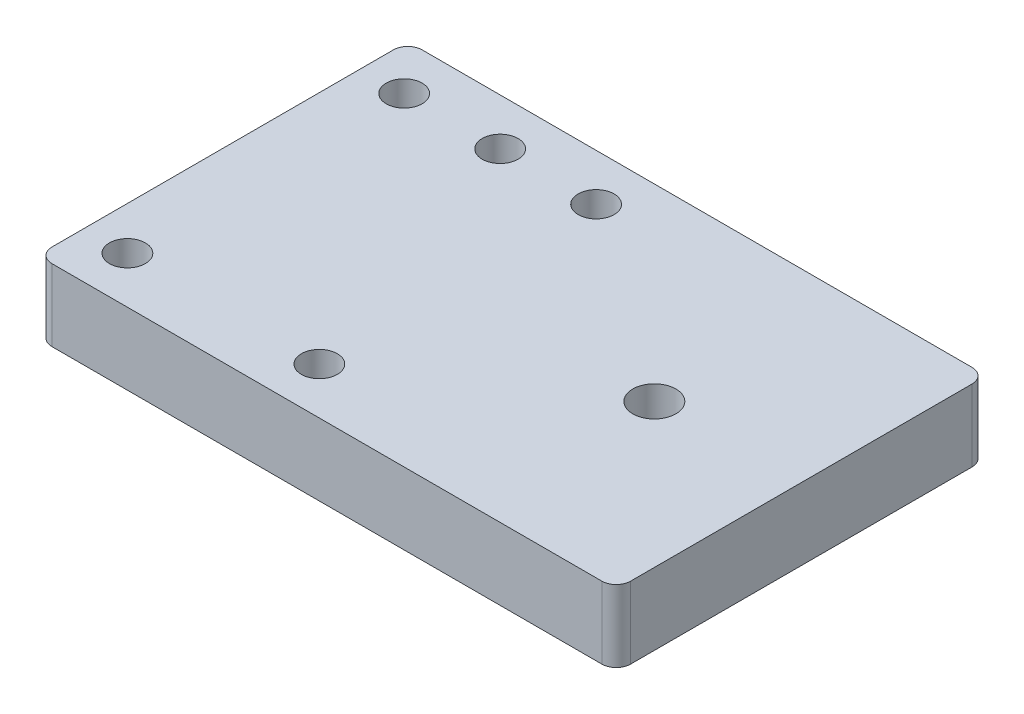
ISO-10303-21;
HEADER;
FILE_DESCRIPTION(('STEP AP214'),'2;1');
FILE_NAME('part.step','',(''),(''),'','','');
FILE_SCHEMA(('AUTOMOTIVE_DESIGN { 1 0 10303 214 1 1 1 1 }'));
ENDSEC;
DATA;
#1=APPLICATION_CONTEXT('core data for automotive mechanical design processes');
#2=APPLICATION_PROTOCOL_DEFINITION('international standard','automotive_design',2000,#1);
#3=PRODUCT_CONTEXT('',#1,'mechanical');
#4=PRODUCT('Part','Part','',(#3));
#5=PRODUCT_RELATED_PRODUCT_CATEGORY('part','',(#4));
#6=PRODUCT_DEFINITION_FORMATION('','',#4);
#7=PRODUCT_DEFINITION_CONTEXT('part definition',#1,'design');
#8=PRODUCT_DEFINITION('design','',#6,#7);
#9=PRODUCT_DEFINITION_SHAPE('','',#8);
#10=(LENGTH_UNIT() NAMED_UNIT(*) SI_UNIT(.MILLI.,.METRE.));
#11=(NAMED_UNIT(*) PLANE_ANGLE_UNIT() SI_UNIT($,.RADIAN.));
#12=(NAMED_UNIT(*) SI_UNIT($,.STERADIAN.) SOLID_ANGLE_UNIT());
#13=UNCERTAINTY_MEASURE_WITH_UNIT(LENGTH_MEASURE(1.E-05),#10,'distance_accuracy_value','');
#14=(GEOMETRIC_REPRESENTATION_CONTEXT(3) GLOBAL_UNCERTAINTY_ASSIGNED_CONTEXT((#13)) GLOBAL_UNIT_ASSIGNED_CONTEXT((#10,
#11,#12)) REPRESENTATION_CONTEXT('',''));
#15=CARTESIAN_POINT('',(0.,0.,0.));
#16=DIRECTION('',(0.,0.,1.));
#17=DIRECTION('',(1.,0.,0.));
#18=AXIS2_PLACEMENT_3D('',#15,#16,#17);
#19=CARTESIAN_POINT('',(40.2499999999999,10.,25.75));
#20=DIRECTION('',(-1.,0.,0.));
#21=DIRECTION('',(0.,0.,1.));
#22=AXIS2_PLACEMENT_3D('',#19,#20,#21);
#23=PLANE('',#22);
#24=DIRECTION('',(0.,0.,-1.));
#25=VECTOR('',#24,1.);
#26=CARTESIAN_POINT('',(40.2499999999999,0.,25.75));
#27=LINE('',#26,#25);
#28=CARTESIAN_POINT('',(40.2499999999999,0.,23.75));
#29=VERTEX_POINT('',#28);
#30=CARTESIAN_POINT('',(40.2499999999999,0.,-23.7499999999998));
#31=VERTEX_POINT('',#30);
#32=EDGE_CURVE('E126',#29,#31,#27,.T.);
#33=ORIENTED_EDGE('',*,*,#32,.T.);
#34=DIRECTION('',(0.,-1.,0.));
#35=VECTOR('',#34,1.);
#36=CARTESIAN_POINT('',(40.2499999999999,10.,-23.7499999999998));
#37=LINE('',#36,#35);
#38=CARTESIAN_POINT('',(40.2499999999999,10.,-23.7499999999998));
#39=VERTEX_POINT('',#38);
#40=EDGE_CURVE('E104',#31,#39,#37,.F.);
#41=ORIENTED_EDGE('',*,*,#40,.T.);
#42=DIRECTION('',(0.,0.,-1.));
#43=VECTOR('',#42,1.);
#44=CARTESIAN_POINT('',(40.2499999999999,10.,25.75));
#45=LINE('',#44,#43);
#46=CARTESIAN_POINT('',(40.2499999999999,10.,23.75));
#47=VERTEX_POINT('',#46);
#48=EDGE_CURVE('E136',#47,#39,#45,.T.);
#49=ORIENTED_EDGE('',*,*,#48,.F.);
#50=DIRECTION('',(0.,-1.,0.));
#51=VECTOR('',#50,1.);
#52=CARTESIAN_POINT('',(40.2499999999999,10.,23.75));
#53=LINE('',#52,#51);
#54=EDGE_CURVE('E109',#47,#29,#53,.T.);
#55=ORIENTED_EDGE('',*,*,#54,.T.);
#56=EDGE_LOOP('',(#33,#41,#49,#55));
#57=FACE_BOUND('',#56,.T.);
#58=ADVANCED_FACE('F33',(#57),#23,.F.);
#59=CARTESIAN_POINT('',(-40.2500000000001,10.,-25.7499999999998));
#60=DIRECTION('',(0.,0.,1.));
#61=DIRECTION('',(1.,0.,0.));
#62=AXIS2_PLACEMENT_3D('',#59,#60,#61);
#63=PLANE('',#62);
#64=DIRECTION('',(-1.,0.,0.));
#65=VECTOR('',#64,1.);
#66=CARTESIAN_POINT('',(-40.2500000000001,10.,-25.7499999999998));
#67=LINE('',#66,#65);
#68=CARTESIAN_POINT('',(38.2499999999999,10.,-25.7499999999998));
#69=VERTEX_POINT('',#68);
#70=CARTESIAN_POINT('',(-38.2500000000001,10.,-25.7499999999998));
#71=VERTEX_POINT('',#70);
#72=EDGE_CURVE('E119',#69,#71,#67,.T.);
#73=ORIENTED_EDGE('',*,*,#72,.F.);
#74=DIRECTION('',(0.,-1.,0.));
#75=VECTOR('',#74,1.);
#76=CARTESIAN_POINT('',(38.2499999999999,10.,-25.7499999999998));
#77=LINE('',#76,#75);
#78=CARTESIAN_POINT('',(38.2499999999999,0.,-25.7499999999998));
#79=VERTEX_POINT('',#78);
#80=EDGE_CURVE('E103',#69,#79,#77,.T.);
#81=ORIENTED_EDGE('',*,*,#80,.T.);
#82=DIRECTION('',(-1.,0.,0.));
#83=VECTOR('',#82,1.);
#84=CARTESIAN_POINT('',(-40.2500000000001,0.,-25.7499999999998));
#85=LINE('',#84,#83);
#86=CARTESIAN_POINT('',(-38.2500000000001,0.,-25.7499999999998));
#87=VERTEX_POINT('',#86);
#88=EDGE_CURVE('E116',#79,#87,#85,.T.);
#89=ORIENTED_EDGE('',*,*,#88,.T.);
#90=DIRECTION('',(0.,-1.,0.));
#91=VECTOR('',#90,1.);
#92=CARTESIAN_POINT('',(-38.2500000000001,10.,-25.7499999999998));
#93=LINE('',#92,#91);
#94=EDGE_CURVE('E121',#87,#71,#93,.F.);
#95=ORIENTED_EDGE('',*,*,#94,.T.);
#96=EDGE_LOOP('',(#73,#81,#89,#95));
#97=FACE_BOUND('',#96,.T.);
#98=ADVANCED_FACE('F115',(#97),#63,.F.);
#99=CARTESIAN_POINT('',(-40.2500000000001,10.,25.75));
#100=DIRECTION('',(1.,0.,0.));
#101=DIRECTION('',(0.,0.,-1.));
#102=AXIS2_PLACEMENT_3D('',#99,#100,#101);
#103=PLANE('',#102);
#104=DIRECTION('',(0.,0.,1.));
#105=VECTOR('',#104,1.);
#106=CARTESIAN_POINT('',(-40.2500000000001,0.,25.75));
#107=LINE('',#106,#105);
#108=CARTESIAN_POINT('',(-40.2500000000001,0.,-23.7499999999998));
#109=VERTEX_POINT('',#108);
#110=CARTESIAN_POINT('',(-40.2500000000001,0.,23.75));
#111=VERTEX_POINT('',#110);
#112=EDGE_CURVE('E125',#109,#111,#107,.T.);
#113=ORIENTED_EDGE('',*,*,#112,.T.);
#114=DIRECTION('',(0.,-1.,0.));
#115=VECTOR('',#114,1.);
#116=CARTESIAN_POINT('',(-40.2500000000001,10.,23.75));
#117=LINE('',#116,#115);
#118=CARTESIAN_POINT('',(-40.2500000000001,10.,23.75));
#119=VERTEX_POINT('',#118);
#120=EDGE_CURVE('E11',#111,#119,#117,.F.);
#121=ORIENTED_EDGE('',*,*,#120,.T.);
#122=DIRECTION('',(0.,0.,1.));
#123=VECTOR('',#122,1.);
#124=CARTESIAN_POINT('',(-40.2500000000001,10.,25.75));
#125=LINE('',#124,#123);
#126=CARTESIAN_POINT('',(-40.2500000000001,10.,-23.7499999999998));
#127=VERTEX_POINT('',#126);
#128=EDGE_CURVE('E162',#127,#119,#125,.T.);
#129=ORIENTED_EDGE('',*,*,#128,.F.);
#130=DIRECTION('',(0.,-1.,0.));
#131=VECTOR('',#130,1.);
#132=CARTESIAN_POINT('',(-40.2500000000001,10.,-23.7499999999998));
#133=LINE('',#132,#131);
#134=EDGE_CURVE('E41',#127,#109,#133,.T.);
#135=ORIENTED_EDGE('',*,*,#134,.T.);
#136=EDGE_LOOP('',(#113,#121,#129,#135));
#137=FACE_BOUND('',#136,.T.);
#138=ADVANCED_FACE('F160',(#137),#103,.F.);
#139=CARTESIAN_POINT('',(-40.2500000000001,10.,25.75));
#140=DIRECTION('',(0.,0.,-1.));
#141=DIRECTION('',(-1.,0.,0.));
#142=AXIS2_PLACEMENT_3D('',#139,#140,#141);
#143=PLANE('',#142);
#144=DIRECTION('',(1.,0.,0.));
#145=VECTOR('',#144,1.);
#146=CARTESIAN_POINT('',(-40.2500000000001,0.,25.75));
#147=LINE('',#146,#145);
#148=CARTESIAN_POINT('',(-38.2500000000001,0.,25.75));
#149=VERTEX_POINT('',#148);
#150=CARTESIAN_POINT('',(38.2499999999999,0.,25.75));
#151=VERTEX_POINT('',#150);
#152=EDGE_CURVE('E129',#149,#151,#147,.T.);
#153=ORIENTED_EDGE('',*,*,#152,.T.);
#154=DIRECTION('',(0.,-1.,0.));
#155=VECTOR('',#154,1.);
#156=CARTESIAN_POINT('',(38.2499999999999,10.,25.75));
#157=LINE('',#156,#155);
#158=CARTESIAN_POINT('',(38.2499999999999,10.,25.75));
#159=VERTEX_POINT('',#158);
#160=EDGE_CURVE('E48',#151,#159,#157,.F.);
#161=ORIENTED_EDGE('',*,*,#160,.T.);
#162=DIRECTION('',(1.,0.,0.));
#163=VECTOR('',#162,1.);
#164=CARTESIAN_POINT('',(-40.2500000000001,10.,25.75));
#165=LINE('',#164,#163);
#166=CARTESIAN_POINT('',(-38.2500000000001,10.,25.75));
#167=VERTEX_POINT('',#166);
#168=EDGE_CURVE('E137',#167,#159,#165,.T.);
#169=ORIENTED_EDGE('',*,*,#168,.F.);
#170=DIRECTION('',(0.,-1.,0.));
#171=VECTOR('',#170,1.);
#172=CARTESIAN_POINT('',(-38.2500000000001,10.,25.75));
#173=LINE('',#172,#171);
#174=EDGE_CURVE('E153',#167,#149,#173,.T.);
#175=ORIENTED_EDGE('',*,*,#174,.T.);
#176=EDGE_LOOP('',(#153,#161,#169,#175));
#177=FACE_BOUND('',#176,.T.);
#178=ADVANCED_FACE('F169',(#177),#143,.F.);
#179=CARTESIAN_POINT('',(0.,10.,0.));
#180=DIRECTION('',(0.,-1.,0.));
#181=DIRECTION('',(0.,0.,-1.));
#182=AXIS2_PLACEMENT_3D('',#179,#180,#181);
#183=PLANE('',#182);
#184=CARTESIAN_POINT('',(20.2499999999999,10.,0.450000000000051));
#185=DIRECTION('',(0.,1.,0.));
#186=DIRECTION('',(0.,0.,1.));
#187=AXIS2_PLACEMENT_3D('',#184,#185,#186);
#188=CIRCLE('',#187,3.);
#189=CARTESIAN_POINT('',(20.2499999999999,10.,3.45000000000005));
#190=VERTEX_POINT('',#189);
#191=EDGE_CURVE('E206',#190,#190,#188,.T.);
#192=ORIENTED_EDGE('',*,*,#191,.F.);
#193=EDGE_LOOP('',(#192));
#194=FACE_BOUND('',#193,.T.);
#195=CARTESIAN_POINT('',(-20.9000000000001,10.,-19.25));
#196=DIRECTION('',(0.,1.,0.));
#197=DIRECTION('',(0.,0.,1.));
#198=AXIS2_PLACEMENT_3D('',#195,#196,#197);
#199=CIRCLE('',#198,2.5);
#200=CARTESIAN_POINT('',(-20.9000000000001,10.,-16.75));
#201=VERTEX_POINT('',#200);
#202=EDGE_CURVE('E200',#201,#201,#199,.T.);
#203=ORIENTED_EDGE('',*,*,#202,.F.);
#204=EDGE_LOOP('',(#203));
#205=FACE_BOUND('',#204,.T.);
#206=CARTESIAN_POINT('',(-34.2500000000001,10.,19.25));
#207=DIRECTION('',(0.,-1.,0.));
#208=DIRECTION('',(0.,0.,-1.));
#209=AXIS2_PLACEMENT_3D('',#206,#207,#208);
#210=CIRCLE('',#209,2.49999999999999);
#211=CARTESIAN_POINT('',(-34.2500000000001,10.,16.75));
#212=VERTEX_POINT('',#211);
#213=EDGE_CURVE('E194',#212,#212,#210,.T.);
#214=ORIENTED_EDGE('',*,*,#213,.T.);
#215=EDGE_LOOP('',(#214));
#216=FACE_BOUND('',#215,.T.);
#217=CARTESIAN_POINT('',(-7.55000000000009,10.,19.25));
#218=DIRECTION('',(0.,1.,0.));
#219=DIRECTION('',(0.,0.,-1.));
#220=AXIS2_PLACEMENT_3D('',#217,#218,#219);
#221=CIRCLE('',#220,2.49999999999999);
#222=CARTESIAN_POINT('',(-7.55000000000009,10.,16.75));
#223=VERTEX_POINT('',#222);
#224=EDGE_CURVE('E188',#223,#223,#221,.T.);
#225=ORIENTED_EDGE('',*,*,#224,.F.);
#226=EDGE_LOOP('',(#225));
#227=FACE_BOUND('',#226,.T.);
#228=CARTESIAN_POINT('',(-7.55000000000009,10.,-19.25));
#229=DIRECTION('',(0.,-1.,0.));
#230=DIRECTION('',(0.,0.,1.));
#231=AXIS2_PLACEMENT_3D('',#228,#229,#230);
#232=CIRCLE('',#231,2.49999999999999);
#233=CARTESIAN_POINT('',(-7.55000000000009,10.,-16.75));
#234=VERTEX_POINT('',#233);
#235=EDGE_CURVE('E182',#234,#234,#232,.T.);
#236=ORIENTED_EDGE('',*,*,#235,.T.);
#237=EDGE_LOOP('',(#236));
#238=FACE_BOUND('',#237,.T.);
#239=CARTESIAN_POINT('',(-34.2500000000001,10.,-19.25));
#240=DIRECTION('',(0.,1.,0.));
#241=DIRECTION('',(0.,0.,1.));
#242=AXIS2_PLACEMENT_3D('',#239,#240,#241);
#243=CIRCLE('',#242,2.49999999999999);
#244=CARTESIAN_POINT('',(-34.2500000000001,10.,-16.75));
#245=VERTEX_POINT('',#244);
#246=EDGE_CURVE('E176',#245,#245,#243,.T.);
#247=ORIENTED_EDGE('',*,*,#246,.F.);
#248=EDGE_LOOP('',(#247));
#249=FACE_BOUND('',#248,.T.);
#250=ORIENTED_EDGE('',*,*,#48,.T.);
#251=CARTESIAN_POINT('',(38.2499999999999,10.,-23.7499999999998));
#252=DIRECTION('',(0.,-1.,0.));
#253=DIRECTION('',(0.,0.,-1.));
#254=AXIS2_PLACEMENT_3D('',#251,#252,#253);
#255=CIRCLE('',#254,2.);
#256=EDGE_CURVE('E151',#39,#69,#255,.F.);
#257=ORIENTED_EDGE('',*,*,#256,.T.);
#258=ORIENTED_EDGE('',*,*,#72,.T.);
#259=CARTESIAN_POINT('',(-38.2500000000001,10.,-23.7499999999998));
#260=DIRECTION('',(0.,-1.,0.));
#261=DIRECTION('',(0.,0.,-1.));
#262=AXIS2_PLACEMENT_3D('',#259,#260,#261);
#263=CIRCLE('',#262,2.);
#264=EDGE_CURVE('E146',#71,#127,#263,.F.);
#265=ORIENTED_EDGE('',*,*,#264,.T.);
#266=ORIENTED_EDGE('',*,*,#128,.T.);
#267=CARTESIAN_POINT('',(-38.2500000000001,10.,23.75));
#268=DIRECTION('',(0.,-1.,0.));
#269=DIRECTION('',(0.,0.,-1.));
#270=AXIS2_PLACEMENT_3D('',#267,#268,#269);
#271=CIRCLE('',#270,2.);
#272=EDGE_CURVE('E55',#119,#167,#271,.F.);
#273=ORIENTED_EDGE('',*,*,#272,.T.);
#274=ORIENTED_EDGE('',*,*,#168,.T.);
#275=CARTESIAN_POINT('',(38.2499999999999,10.,23.75));
#276=DIRECTION('',(0.,-1.,0.));
#277=DIRECTION('',(0.,0.,-1.));
#278=AXIS2_PLACEMENT_3D('',#275,#276,#277);
#279=CIRCLE('',#278,2.);
#280=EDGE_CURVE('E149',#159,#47,#279,.F.);
#281=ORIENTED_EDGE('',*,*,#280,.T.);
#282=EDGE_LOOP('',(#250,#257,#258,#265,#266,#273,#274,#281));
#283=FACE_BOUND('',#282,.T.);
#284=ADVANCED_FACE('F221',(#194,#205,#216,#227,#238,#249,#283),#183,.F.);
#285=CARTESIAN_POINT('',(0.,0.,0.));
#286=DIRECTION('',(0.,-1.,0.));
#287=DIRECTION('',(0.,0.,-1.));
#288=AXIS2_PLACEMENT_3D('',#285,#286,#287);
#289=PLANE('',#288);
#290=CARTESIAN_POINT('',(20.2499999999999,0.,0.450000000000051));
#291=DIRECTION('',(0.,1.,0.));
#292=DIRECTION('',(0.,0.,1.));
#293=AXIS2_PLACEMENT_3D('',#290,#291,#292);
#294=CIRCLE('',#293,3.);
#295=CARTESIAN_POINT('',(20.2499999999999,0.,3.45000000000005));
#296=VERTEX_POINT('',#295);
#297=EDGE_CURVE('E203',#296,#296,#294,.T.);
#298=ORIENTED_EDGE('',*,*,#297,.T.);
#299=EDGE_LOOP('',(#298));
#300=FACE_BOUND('',#299,.T.);
#301=CARTESIAN_POINT('',(-20.9000000000001,0.,-19.25));
#302=DIRECTION('',(0.,1.,0.));
#303=DIRECTION('',(0.,0.,1.));
#304=AXIS2_PLACEMENT_3D('',#301,#302,#303);
#305=CIRCLE('',#304,2.5);
#306=CARTESIAN_POINT('',(-20.9000000000001,0.,-16.75));
#307=VERTEX_POINT('',#306);
#308=EDGE_CURVE('E197',#307,#307,#305,.T.);
#309=ORIENTED_EDGE('',*,*,#308,.T.);
#310=EDGE_LOOP('',(#309));
#311=FACE_BOUND('',#310,.T.);
#312=CARTESIAN_POINT('',(-34.2500000000001,0.,19.25));
#313=DIRECTION('',(0.,-1.,0.));
#314=DIRECTION('',(0.,0.,-1.));
#315=AXIS2_PLACEMENT_3D('',#312,#313,#314);
#316=CIRCLE('',#315,2.49999999999999);
#317=CARTESIAN_POINT('',(-34.2500000000001,0.,16.75));
#318=VERTEX_POINT('',#317);
#319=EDGE_CURVE('E191',#318,#318,#316,.T.);
#320=ORIENTED_EDGE('',*,*,#319,.F.);
#321=EDGE_LOOP('',(#320));
#322=FACE_BOUND('',#321,.T.);
#323=CARTESIAN_POINT('',(-7.55000000000009,0.,19.25));
#324=DIRECTION('',(0.,1.,0.));
#325=DIRECTION('',(0.,0.,-1.));
#326=AXIS2_PLACEMENT_3D('',#323,#324,#325);
#327=CIRCLE('',#326,2.49999999999999);
#328=CARTESIAN_POINT('',(-7.55000000000009,0.,16.75));
#329=VERTEX_POINT('',#328);
#330=EDGE_CURVE('E185',#329,#329,#327,.T.);
#331=ORIENTED_EDGE('',*,*,#330,.T.);
#332=EDGE_LOOP('',(#331));
#333=FACE_BOUND('',#332,.T.);
#334=CARTESIAN_POINT('',(-7.55000000000009,0.,-19.25));
#335=DIRECTION('',(0.,-1.,0.));
#336=DIRECTION('',(0.,0.,1.));
#337=AXIS2_PLACEMENT_3D('',#334,#335,#336);
#338=CIRCLE('',#337,2.49999999999999);
#339=CARTESIAN_POINT('',(-7.55000000000009,0.,-16.75));
#340=VERTEX_POINT('',#339);
#341=EDGE_CURVE('E179',#340,#340,#338,.T.);
#342=ORIENTED_EDGE('',*,*,#341,.F.);
#343=EDGE_LOOP('',(#342));
#344=FACE_BOUND('',#343,.T.);
#345=CARTESIAN_POINT('',(-34.2500000000001,0.,-19.25));
#346=DIRECTION('',(0.,1.,0.));
#347=DIRECTION('',(0.,0.,1.));
#348=AXIS2_PLACEMENT_3D('',#345,#346,#347);
#349=CIRCLE('',#348,2.49999999999999);
#350=CARTESIAN_POINT('',(-34.2500000000001,0.,-16.75));
#351=VERTEX_POINT('',#350);
#352=EDGE_CURVE('E131',#351,#351,#349,.T.);
#353=ORIENTED_EDGE('',*,*,#352,.T.);
#354=EDGE_LOOP('',(#353));
#355=FACE_BOUND('',#354,.T.);
#356=ORIENTED_EDGE('',*,*,#88,.F.);
#357=CARTESIAN_POINT('',(38.2499999999999,0.,-23.7499999999998));
#358=DIRECTION('',(0.,-1.,0.));
#359=DIRECTION('',(0.,0.,-1.));
#360=AXIS2_PLACEMENT_3D('',#357,#358,#359);
#361=CIRCLE('',#360,2.);
#362=EDGE_CURVE('E99',#79,#31,#361,.T.);
#363=ORIENTED_EDGE('',*,*,#362,.T.);
#364=ORIENTED_EDGE('',*,*,#32,.F.);
#365=CARTESIAN_POINT('',(38.2499999999999,0.,23.75));
#366=DIRECTION('',(0.,-1.,0.));
#367=DIRECTION('',(0.,0.,-1.));
#368=AXIS2_PLACEMENT_3D('',#365,#366,#367);
#369=CIRCLE('',#368,2.);
#370=EDGE_CURVE('E110',#29,#151,#369,.T.);
#371=ORIENTED_EDGE('',*,*,#370,.T.);
#372=ORIENTED_EDGE('',*,*,#152,.F.);
#373=CARTESIAN_POINT('',(-38.2500000000001,0.,23.75));
#374=DIRECTION('',(0.,-1.,0.));
#375=DIRECTION('',(0.,0.,-1.));
#376=AXIS2_PLACEMENT_3D('',#373,#374,#375);
#377=CIRCLE('',#376,2.);
#378=EDGE_CURVE('E140',#149,#111,#377,.T.);
#379=ORIENTED_EDGE('',*,*,#378,.T.);
#380=ORIENTED_EDGE('',*,*,#112,.F.);
#381=CARTESIAN_POINT('',(-38.2500000000001,0.,-23.7499999999998));
#382=DIRECTION('',(0.,-1.,0.));
#383=DIRECTION('',(0.,0.,-1.));
#384=AXIS2_PLACEMENT_3D('',#381,#382,#383);
#385=CIRCLE('',#384,2.);
#386=EDGE_CURVE('E120',#109,#87,#385,.T.);
#387=ORIENTED_EDGE('',*,*,#386,.T.);
#388=EDGE_LOOP('',(#356,#363,#364,#371,#372,#379,#380,#387));
#389=FACE_BOUND('',#388,.T.);
#390=ADVANCED_FACE('F123',(#300,#311,#322,#333,#344,#355,#389),#289,.T.);
#391=CARTESIAN_POINT('',(-34.2500000000001,0.,-19.25));
#392=DIRECTION('',(0.,1.,0.));
#393=DIRECTION('',(0.,0.,1.));
#394=AXIS2_PLACEMENT_3D('',#391,#392,#393);
#395=CYLINDRICAL_SURFACE('',#394,2.49999999999999);
#396=ORIENTED_EDGE('',*,*,#352,.F.);
#397=EDGE_LOOP('',(#396));
#398=FACE_BOUND('',#397,.T.);
#399=ORIENTED_EDGE('',*,*,#246,.T.);
#400=EDGE_LOOP('',(#399));
#401=FACE_BOUND('',#400,.T.);
#402=ADVANCED_FACE('F258',(#398,#401),#395,.F.);
#403=CARTESIAN_POINT('',(-7.55000000000009,0.,-19.25));
#404=DIRECTION('',(0.,1.,0.));
#405=DIRECTION('',(0.,0.,1.));
#406=AXIS2_PLACEMENT_3D('',#403,#404,#405);
#407=CYLINDRICAL_SURFACE('',#406,2.49999999999999);
#408=ORIENTED_EDGE('',*,*,#341,.T.);
#409=EDGE_LOOP('',(#408));
#410=FACE_BOUND('',#409,.T.);
#411=ORIENTED_EDGE('',*,*,#235,.F.);
#412=EDGE_LOOP('',(#411));
#413=FACE_BOUND('',#412,.T.);
#414=ADVANCED_FACE('F262',(#410,#413),#407,.F.);
#415=CARTESIAN_POINT('',(-7.55000000000009,0.,19.25));
#416=DIRECTION('',(0.,1.,0.));
#417=DIRECTION('',(0.,0.,1.));
#418=AXIS2_PLACEMENT_3D('',#415,#416,#417);
#419=CYLINDRICAL_SURFACE('',#418,2.49999999999999);
#420=ORIENTED_EDGE('',*,*,#330,.F.);
#421=EDGE_LOOP('',(#420));
#422=FACE_BOUND('',#421,.T.);
#423=ORIENTED_EDGE('',*,*,#224,.T.);
#424=EDGE_LOOP('',(#423));
#425=FACE_BOUND('',#424,.T.);
#426=ADVANCED_FACE('F266',(#422,#425),#419,.F.);
#427=CARTESIAN_POINT('',(-34.2500000000001,0.,19.25));
#428=DIRECTION('',(0.,1.,0.));
#429=DIRECTION('',(0.,0.,1.));
#430=AXIS2_PLACEMENT_3D('',#427,#428,#429);
#431=CYLINDRICAL_SURFACE('',#430,2.49999999999999);
#432=ORIENTED_EDGE('',*,*,#319,.T.);
#433=EDGE_LOOP('',(#432));
#434=FACE_BOUND('',#433,.T.);
#435=ORIENTED_EDGE('',*,*,#213,.F.);
#436=EDGE_LOOP('',(#435));
#437=FACE_BOUND('',#436,.T.);
#438=ADVANCED_FACE('F270',(#434,#437),#431,.F.);
#439=CARTESIAN_POINT('',(-20.9000000000001,0.,-19.25));
#440=DIRECTION('',(0.,1.,0.));
#441=DIRECTION('',(0.,0.,1.));
#442=AXIS2_PLACEMENT_3D('',#439,#440,#441);
#443=CYLINDRICAL_SURFACE('',#442,2.5);
#444=ORIENTED_EDGE('',*,*,#308,.F.);
#445=EDGE_LOOP('',(#444));
#446=FACE_BOUND('',#445,.T.);
#447=ORIENTED_EDGE('',*,*,#202,.T.);
#448=EDGE_LOOP('',(#447));
#449=FACE_BOUND('',#448,.T.);
#450=ADVANCED_FACE('F217',(#446,#449),#443,.F.);
#451=CARTESIAN_POINT('',(20.2499999999999,0.,0.450000000000051));
#452=DIRECTION('',(0.,1.,0.));
#453=DIRECTION('',(0.,0.,1.));
#454=AXIS2_PLACEMENT_3D('',#451,#452,#453);
#455=CYLINDRICAL_SURFACE('',#454,3.);
#456=ORIENTED_EDGE('',*,*,#297,.F.);
#457=EDGE_LOOP('',(#456));
#458=FACE_BOUND('',#457,.T.);
#459=ORIENTED_EDGE('',*,*,#191,.T.);
#460=EDGE_LOOP('',(#459));
#461=FACE_BOUND('',#460,.T.);
#462=ADVANCED_FACE('F214',(#458,#461),#455,.F.);
#463=CARTESIAN_POINT('',(38.2499999999999,10.,-23.7499999999998));
#464=DIRECTION('',(0.,-1.,0.));
#465=DIRECTION('',(0.,0.,-1.));
#466=AXIS2_PLACEMENT_3D('',#463,#464,#465);
#467=CYLINDRICAL_SURFACE('',#466,2.);
#468=ORIENTED_EDGE('',*,*,#256,.F.);
#469=ORIENTED_EDGE('',*,*,#40,.F.);
#470=ORIENTED_EDGE('',*,*,#362,.F.);
#471=ORIENTED_EDGE('',*,*,#80,.F.);
#472=EDGE_LOOP('',(#468,#469,#470,#471));
#473=FACE_BOUND('',#472,.T.);
#474=ADVANCED_FACE('F102',(#473),#467,.T.);
#475=CARTESIAN_POINT('',(38.2499999999999,10.,23.75));
#476=DIRECTION('',(0.,-1.,0.));
#477=DIRECTION('',(0.,0.,-1.));
#478=AXIS2_PLACEMENT_3D('',#475,#476,#477);
#479=CYLINDRICAL_SURFACE('',#478,2.);
#480=ORIENTED_EDGE('',*,*,#280,.F.);
#481=ORIENTED_EDGE('',*,*,#160,.F.);
#482=ORIENTED_EDGE('',*,*,#370,.F.);
#483=ORIENTED_EDGE('',*,*,#54,.F.);
#484=EDGE_LOOP('',(#480,#481,#482,#483));
#485=FACE_BOUND('',#484,.T.);
#486=ADVANCED_FACE('F238',(#485),#479,.T.);
#487=CARTESIAN_POINT('',(-38.2500000000001,10.,23.75));
#488=DIRECTION('',(0.,-1.,0.));
#489=DIRECTION('',(0.,0.,-1.));
#490=AXIS2_PLACEMENT_3D('',#487,#488,#489);
#491=CYLINDRICAL_SURFACE('',#490,2.);
#492=ORIENTED_EDGE('',*,*,#272,.F.);
#493=ORIENTED_EDGE('',*,*,#120,.F.);
#494=ORIENTED_EDGE('',*,*,#378,.F.);
#495=ORIENTED_EDGE('',*,*,#174,.F.);
#496=EDGE_LOOP('',(#492,#493,#494,#495));
#497=FACE_BOUND('',#496,.T.);
#498=ADVANCED_FACE('F168',(#497),#491,.T.);
#499=CARTESIAN_POINT('',(-38.2500000000001,10.,-23.7499999999998));
#500=DIRECTION('',(0.,-1.,0.));
#501=DIRECTION('',(0.,0.,-1.));
#502=AXIS2_PLACEMENT_3D('',#499,#500,#501);
#503=CYLINDRICAL_SURFACE('',#502,2.);
#504=ORIENTED_EDGE('',*,*,#264,.F.);
#505=ORIENTED_EDGE('',*,*,#94,.F.);
#506=ORIENTED_EDGE('',*,*,#386,.F.);
#507=ORIENTED_EDGE('',*,*,#134,.F.);
#508=EDGE_LOOP('',(#504,#505,#506,#507));
#509=FACE_BOUND('',#508,.T.);
#510=ADVANCED_FACE('F35',(#509),#503,.T.);
#511=CLOSED_SHELL('',(#58,#98,#138,#178,#284,#390,#402,#414,#426,#438,#450,#462,#474,#486,#498,#510));
#512=MANIFOLD_SOLID_BREP('B2',#511);
#513=ADVANCED_BREP_SHAPE_REPRESENTATION('',(#18,#512),#14);
#514=SHAPE_DEFINITION_REPRESENTATION(#9,#513);
ENDSEC;
END-ISO-10303-21;
